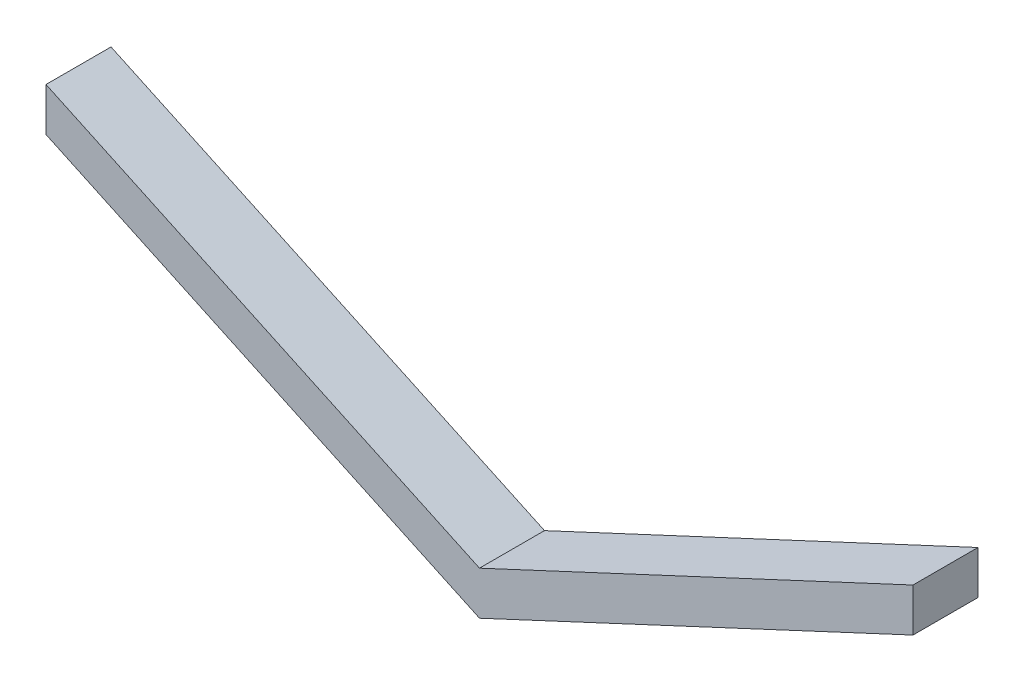
ISO-10303-21;
HEADER;
FILE_DESCRIPTION(('STEP AP214'),'2;1');
FILE_NAME('part.step','',(''),(''),'','','');
FILE_SCHEMA(('AUTOMOTIVE_DESIGN { 1 0 10303 214 1 1 1 1 }'));
ENDSEC;
DATA;
#1=APPLICATION_CONTEXT('core data for automotive mechanical design processes');
#2=APPLICATION_PROTOCOL_DEFINITION('international standard','automotive_design',2000,#1);
#3=PRODUCT_CONTEXT('',#1,'mechanical');
#4=PRODUCT('Part','Part','',(#3));
#5=PRODUCT_RELATED_PRODUCT_CATEGORY('part','',(#4));
#6=PRODUCT_DEFINITION_FORMATION('','',#4);
#7=PRODUCT_DEFINITION_CONTEXT('part definition',#1,'design');
#8=PRODUCT_DEFINITION('design','',#6,#7);
#9=PRODUCT_DEFINITION_SHAPE('','',#8);
#10=(LENGTH_UNIT() NAMED_UNIT(*) SI_UNIT(.MILLI.,.METRE.));
#11=(NAMED_UNIT(*) PLANE_ANGLE_UNIT() SI_UNIT($,.RADIAN.));
#12=(NAMED_UNIT(*) SI_UNIT($,.STERADIAN.) SOLID_ANGLE_UNIT());
#13=UNCERTAINTY_MEASURE_WITH_UNIT(LENGTH_MEASURE(1.E-05),#10,'distance_accuracy_value','');
#14=(GEOMETRIC_REPRESENTATION_CONTEXT(3) GLOBAL_UNCERTAINTY_ASSIGNED_CONTEXT((#13)) GLOBAL_UNIT_ASSIGNED_CONTEXT((#10,
#11,#12)) REPRESENTATION_CONTEXT('',''));
#15=CARTESIAN_POINT('',(0.,0.,0.));
#16=DIRECTION('',(0.,0.,1.));
#17=DIRECTION('',(1.,0.,0.));
#18=AXIS2_PLACEMENT_3D('',#15,#16,#17);
#19=CARTESIAN_POINT('',(-200.,113.261531630999,30.));
#20=DIRECTION('',(1.,0.,0.));
#21=DIRECTION('',(0.,0.,-1.));
#22=AXIS2_PLACEMENT_3D('',#19,#20,#21);
#23=PLANE('',#22);
#24=DIRECTION('',(0.,-1.,0.));
#25=VECTOR('',#24,1.);
#26=CARTESIAN_POINT('',(-200.,113.261531630999,0.));
#27=LINE('',#26,#25);
#28=CARTESIAN_POINT('',(-200.,113.261531630999,0.));
#29=VERTEX_POINT('',#28);
#30=CARTESIAN_POINT('',(-200.,93.2615316309993,0.));
#31=VERTEX_POINT('',#30);
#32=EDGE_CURVE('E118',#29,#31,#27,.T.);
#33=ORIENTED_EDGE('',*,*,#32,.T.);
#34=DIRECTION('',(0.,0.,-1.));
#35=VECTOR('',#34,1.);
#36=CARTESIAN_POINT('',(-200.,93.2615316309993,30.));
#37=LINE('',#36,#35);
#38=CARTESIAN_POINT('',(-200.,93.2615316309993,30.));
#39=VERTEX_POINT('',#38);
#40=EDGE_CURVE('E11',#39,#31,#37,.T.);
#41=ORIENTED_EDGE('',*,*,#40,.F.);
#42=DIRECTION('',(0.,-1.,0.));
#43=VECTOR('',#42,1.);
#44=CARTESIAN_POINT('',(-200.,113.261531630999,30.));
#45=LINE('',#44,#43);
#46=CARTESIAN_POINT('',(-200.,113.261531630999,30.));
#47=VERTEX_POINT('',#46);
#48=EDGE_CURVE('E130',#47,#39,#45,.T.);
#49=ORIENTED_EDGE('',*,*,#48,.F.);
#50=DIRECTION('',(0.,0.,-1.));
#51=VECTOR('',#50,1.);
#52=CARTESIAN_POINT('',(-200.,113.261531630999,30.));
#53=LINE('',#52,#51);
#54=EDGE_CURVE('E49',#47,#29,#53,.T.);
#55=ORIENTED_EDGE('',*,*,#54,.T.);
#56=EDGE_LOOP('',(#33,#41,#49,#55));
#57=FACE_BOUND('',#56,.T.);
#58=ADVANCED_FACE('F33',(#57),#23,.F.);
#59=CARTESIAN_POINT('',(-200.,93.2615316309993,30.));
#60=DIRECTION('',(0.422618261740697,0.906307787036651,0.));
#61=DIRECTION('',(-0.906307787036651,0.422618261740697,0.));
#62=AXIS2_PLACEMENT_3D('',#59,#60,#61);
#63=PLANE('',#62);
#64=DIRECTION('',(0.906307787036651,-0.422618261740697,0.));
#65=VECTOR('',#64,1.);
#66=CARTESIAN_POINT('',(-200.,93.2615316309993,0.));
#67=LINE('',#66,#65);
#68=CARTESIAN_POINT('',(0.,0.,0.));
#69=VERTEX_POINT('',#68);
#70=EDGE_CURVE('E120',#31,#69,#67,.T.);
#71=ORIENTED_EDGE('',*,*,#70,.T.);
#72=DIRECTION('',(0.,0.,-1.));
#73=VECTOR('',#72,1.);
#74=CARTESIAN_POINT('',(0.,0.,30.));
#75=LINE('',#74,#73);
#76=CARTESIAN_POINT('',(0.,0.,30.));
#77=VERTEX_POINT('',#76);
#78=EDGE_CURVE('E41',#77,#69,#75,.T.);
#79=ORIENTED_EDGE('',*,*,#78,.F.);
#80=DIRECTION('',(0.906307787036651,-0.422618261740697,0.));
#81=VECTOR('',#80,1.);
#82=CARTESIAN_POINT('',(-200.,93.2615316309993,30.));
#83=LINE('',#82,#81);
#84=EDGE_CURVE('E81',#39,#77,#83,.T.);
#85=ORIENTED_EDGE('',*,*,#84,.F.);
#86=ORIENTED_EDGE('',*,*,#40,.T.);
#87=EDGE_LOOP('',(#71,#79,#85,#86));
#88=FACE_BOUND('',#87,.T.);
#89=ADVANCED_FACE('F150',(#88),#63,.F.);
#90=CARTESIAN_POINT('',(0.,0.,30.));
#91=DIRECTION('',(-0.422618261740704,0.906307787036648,0.));
#92=DIRECTION('',(-0.906307787036648,-0.422618261740704,0.));
#93=AXIS2_PLACEMENT_3D('',#90,#91,#92);
#94=PLANE('',#93);
#95=DIRECTION('',(0.906307787036648,0.422618261740704,0.));
#96=VECTOR('',#95,1.);
#97=CARTESIAN_POINT('',(0.,0.,0.));
#98=LINE('',#97,#96);
#99=CARTESIAN_POINT('',(200.,93.2615316310008,0.));
#100=VERTEX_POINT('',#99);
#101=EDGE_CURVE('E122',#69,#100,#98,.T.);
#102=ORIENTED_EDGE('',*,*,#101,.T.);
#103=DIRECTION('',(0.,0.,-1.));
#104=VECTOR('',#103,1.);
#105=CARTESIAN_POINT('',(200.,93.2615316310008,30.));
#106=LINE('',#105,#104);
#107=CARTESIAN_POINT('',(200.,93.2615316310008,30.));
#108=VERTEX_POINT('',#107);
#109=EDGE_CURVE('E110',#108,#100,#106,.T.);
#110=ORIENTED_EDGE('',*,*,#109,.F.);
#111=DIRECTION('',(0.906307787036648,0.422618261740704,0.));
#112=VECTOR('',#111,1.);
#113=CARTESIAN_POINT('',(0.,0.,30.));
#114=LINE('',#113,#112);
#115=EDGE_CURVE('E98',#77,#108,#114,.T.);
#116=ORIENTED_EDGE('',*,*,#115,.F.);
#117=ORIENTED_EDGE('',*,*,#78,.T.);
#118=EDGE_LOOP('',(#102,#110,#116,#117));
#119=FACE_BOUND('',#118,.T.);
#120=ADVANCED_FACE('F136',(#119),#94,.F.);
#121=CARTESIAN_POINT('',(200.,93.2615316310008,30.));
#122=DIRECTION('',(-1.,0.,0.));
#123=DIRECTION('',(0.,-1.,0.));
#124=AXIS2_PLACEMENT_3D('',#121,#122,#123);
#125=PLANE('',#124);
#126=DIRECTION('',(0.,1.,0.));
#127=VECTOR('',#126,1.);
#128=CARTESIAN_POINT('',(200.,93.2615316310008,0.));
#129=LINE('',#128,#127);
#130=CARTESIAN_POINT('',(200.,113.261531631001,0.));
#131=VERTEX_POINT('',#130);
#132=EDGE_CURVE('E107',#100,#131,#129,.T.);
#133=ORIENTED_EDGE('',*,*,#132,.T.);
#134=DIRECTION('',(0.,0.,-1.));
#135=VECTOR('',#134,1.);
#136=CARTESIAN_POINT('',(200.,113.261531631001,30.));
#137=LINE('',#136,#135);
#138=CARTESIAN_POINT('',(200.,113.261531631001,30.));
#139=VERTEX_POINT('',#138);
#140=EDGE_CURVE('E104',#139,#131,#137,.T.);
#141=ORIENTED_EDGE('',*,*,#140,.F.);
#142=DIRECTION('',(0.,1.,0.));
#143=VECTOR('',#142,1.);
#144=CARTESIAN_POINT('',(200.,93.2615316310008,30.));
#145=LINE('',#144,#143);
#146=EDGE_CURVE('E91',#108,#139,#145,.T.);
#147=ORIENTED_EDGE('',*,*,#146,.F.);
#148=ORIENTED_EDGE('',*,*,#109,.T.);
#149=EDGE_LOOP('',(#133,#141,#147,#148));
#150=FACE_BOUND('',#149,.T.);
#151=ADVANCED_FACE('F105',(#150),#125,.F.);
#152=CARTESIAN_POINT('',(0.,20.,30.));
#153=DIRECTION('',(-0.422618261740704,0.906307787036648,0.));
#154=DIRECTION('',(-0.906307787036648,-0.422618261740704,0.));
#155=AXIS2_PLACEMENT_3D('',#152,#153,#154);
#156=PLANE('',#155);
#157=DIRECTION('',(0.906307787036648,0.422618261740704,0.));
#158=VECTOR('',#157,1.);
#159=CARTESIAN_POINT('',(0.,20.,0.));
#160=LINE('',#159,#158);
#161=CARTESIAN_POINT('',(0.,20.,0.));
#162=VERTEX_POINT('',#161);
#163=EDGE_CURVE('E125',#162,#131,#160,.T.);
#164=ORIENTED_EDGE('',*,*,#163,.F.);
#165=DIRECTION('',(0.,0.,-1.));
#166=VECTOR('',#165,1.);
#167=CARTESIAN_POINT('',(0.,20.,30.));
#168=LINE('',#167,#166);
#169=CARTESIAN_POINT('',(0.,20.,30.));
#170=VERTEX_POINT('',#169);
#171=EDGE_CURVE('E69',#170,#162,#168,.T.);
#172=ORIENTED_EDGE('',*,*,#171,.F.);
#173=DIRECTION('',(0.906307787036648,0.422618261740704,0.));
#174=VECTOR('',#173,1.);
#175=CARTESIAN_POINT('',(0.,20.,30.));
#176=LINE('',#175,#174);
#177=EDGE_CURVE('E96',#170,#139,#176,.T.);
#178=ORIENTED_EDGE('',*,*,#177,.T.);
#179=ORIENTED_EDGE('',*,*,#140,.T.);
#180=EDGE_LOOP('',(#164,#172,#178,#179));
#181=FACE_BOUND('',#180,.T.);
#182=ADVANCED_FACE('F112',(#181),#156,.T.);
#183=CARTESIAN_POINT('',(-200.,113.261531630999,30.));
#184=DIRECTION('',(0.422618261740697,0.906307787036651,0.));
#185=DIRECTION('',(-0.906307787036651,0.422618261740697,0.));
#186=AXIS2_PLACEMENT_3D('',#183,#184,#185);
#187=PLANE('',#186);
#188=DIRECTION('',(0.906307787036651,-0.422618261740697,0.));
#189=VECTOR('',#188,1.);
#190=CARTESIAN_POINT('',(-200.,113.261531630999,0.));
#191=LINE('',#190,#189);
#192=EDGE_CURVE('E127',#29,#162,#191,.T.);
#193=ORIENTED_EDGE('',*,*,#192,.F.);
#194=ORIENTED_EDGE('',*,*,#54,.F.);
#195=DIRECTION('',(0.906307787036651,-0.422618261740697,0.));
#196=VECTOR('',#195,1.);
#197=CARTESIAN_POINT('',(-200.,113.261531630999,30.));
#198=LINE('',#197,#196);
#199=EDGE_CURVE('E113',#47,#170,#198,.T.);
#200=ORIENTED_EDGE('',*,*,#199,.T.);
#201=ORIENTED_EDGE('',*,*,#171,.T.);
#202=EDGE_LOOP('',(#193,#194,#200,#201));
#203=FACE_BOUND('',#202,.T.);
#204=ADVANCED_FACE('F139',(#203),#187,.T.);
#205=CARTESIAN_POINT('',(0.,0.,30.));
#206=DIRECTION('',(0.,0.,1.));
#207=DIRECTION('',(1.,0.,0.));
#208=AXIS2_PLACEMENT_3D('',#205,#206,#207);
#209=PLANE('',#208);
#210=ORIENTED_EDGE('',*,*,#48,.T.);
#211=ORIENTED_EDGE('',*,*,#84,.T.);
#212=ORIENTED_EDGE('',*,*,#115,.T.);
#213=ORIENTED_EDGE('',*,*,#146,.T.);
#214=ORIENTED_EDGE('',*,*,#177,.F.);
#215=ORIENTED_EDGE('',*,*,#199,.F.);
#216=EDGE_LOOP('',(#210,#211,#212,#213,#214,#215));
#217=FACE_BOUND('',#216,.T.);
#218=ADVANCED_FACE('F93',(#217),#209,.T.);
#219=CARTESIAN_POINT('',(0.,0.,0.));
#220=DIRECTION('',(0.,0.,1.));
#221=DIRECTION('',(1.,0.,0.));
#222=AXIS2_PLACEMENT_3D('',#219,#220,#221);
#223=PLANE('',#222);
#224=ORIENTED_EDGE('',*,*,#32,.F.);
#225=ORIENTED_EDGE('',*,*,#192,.T.);
#226=ORIENTED_EDGE('',*,*,#163,.T.);
#227=ORIENTED_EDGE('',*,*,#132,.F.);
#228=ORIENTED_EDGE('',*,*,#101,.F.);
#229=ORIENTED_EDGE('',*,*,#70,.F.);
#230=EDGE_LOOP('',(#224,#225,#226,#227,#228,#229));
#231=FACE_BOUND('',#230,.T.);
#232=ADVANCED_FACE('F138',(#231),#223,.F.);
#233=CLOSED_SHELL('',(#58,#89,#120,#151,#182,#204,#218,#232));
#234=MANIFOLD_SOLID_BREP('B2',#233);
#235=ADVANCED_BREP_SHAPE_REPRESENTATION('',(#18,#234),#14);
#236=SHAPE_DEFINITION_REPRESENTATION(#9,#235);
ENDSEC;
END-ISO-10303-21;
